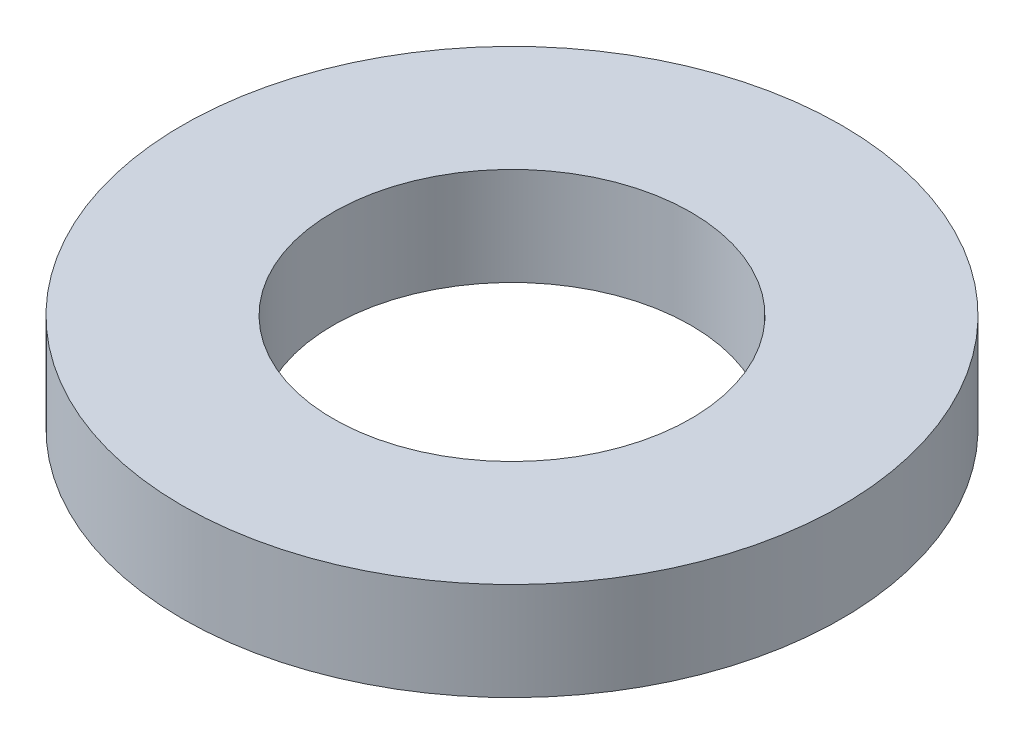
ISO-10303-21;
HEADER;
FILE_DESCRIPTION(('STEP AP214'),'2;1');
FILE_NAME('part.step','',(''),(''),'','','');
FILE_SCHEMA(('AUTOMOTIVE_DESIGN { 1 0 10303 214 1 1 1 1 }'));
ENDSEC;
DATA;
#1=APPLICATION_CONTEXT('core data for automotive mechanical design processes');
#2=APPLICATION_PROTOCOL_DEFINITION('international standard','automotive_design',2000,#1);
#3=PRODUCT_CONTEXT('',#1,'mechanical');
#4=PRODUCT('Part','Part','',(#3));
#5=PRODUCT_RELATED_PRODUCT_CATEGORY('part','',(#4));
#6=PRODUCT_DEFINITION_FORMATION('','',#4);
#7=PRODUCT_DEFINITION_CONTEXT('part definition',#1,'design');
#8=PRODUCT_DEFINITION('design','',#6,#7);
#9=PRODUCT_DEFINITION_SHAPE('','',#8);
#10=(LENGTH_UNIT() NAMED_UNIT(*) SI_UNIT(.MILLI.,.METRE.));
#11=(NAMED_UNIT(*) PLANE_ANGLE_UNIT() SI_UNIT($,.RADIAN.));
#12=(NAMED_UNIT(*) SI_UNIT($,.STERADIAN.) SOLID_ANGLE_UNIT());
#13=UNCERTAINTY_MEASURE_WITH_UNIT(LENGTH_MEASURE(1.E-05),#10,'distance_accuracy_value','');
#14=(GEOMETRIC_REPRESENTATION_CONTEXT(3) GLOBAL_UNCERTAINTY_ASSIGNED_CONTEXT((#13)) GLOBAL_UNIT_ASSIGNED_CONTEXT((#10,
#11,#12)) REPRESENTATION_CONTEXT('',''));
#15=CARTESIAN_POINT('',(0.,0.,0.));
#16=DIRECTION('',(0.,0.,1.));
#17=DIRECTION('',(1.,0.,0.));
#18=AXIS2_PLACEMENT_3D('',#15,#16,#17);
#19=CARTESIAN_POINT('',(0.,26.,0.));
#20=DIRECTION('',(0.,-1.,0.));
#21=DIRECTION('',(0.,0.,-1.));
#22=AXIS2_PLACEMENT_3D('',#19,#20,#21);
#23=CYLINDRICAL_SURFACE('',#22,87.5);
#24=CARTESIAN_POINT('',(0.,26.,0.));
#25=DIRECTION('',(0.,1.,0.));
#26=DIRECTION('',(0.,0.,1.));
#27=AXIS2_PLACEMENT_3D('',#24,#25,#26);
#28=CIRCLE('',#27,87.5);
#29=CARTESIAN_POINT('',(0.,26.,-87.5));
#30=VERTEX_POINT('',#29);
#31=EDGE_CURVE('E10',#30,#30,#28,.T.);
#32=CARTESIAN_POINT('',(0.,0.,0.));
#33=DIRECTION('',(0.,1.,0.));
#34=DIRECTION('',(0.,0.,1.));
#35=AXIS2_PLACEMENT_3D('',#32,#33,#34);
#36=CIRCLE('',#35,87.5);
#37=CARTESIAN_POINT('',(0.,0.,-87.5));
#38=VERTEX_POINT('',#37);
#39=EDGE_CURVE('E37',#38,#38,#36,.T.);
#40=CARTESIAN_POINT('',(0.,26.,-87.5));
#41=CARTESIAN_POINT('',(0.,25.7291666666667,-87.5));
#42=CARTESIAN_POINT('',(0.,25.4583333333333,-87.5));
#43=CARTESIAN_POINT('',(0.,24.9166666666667,-87.5));
#44=CARTESIAN_POINT('',(0.,24.6458333333333,-87.5));
#45=CARTESIAN_POINT('',(0.,24.1041666666667,-87.5));
#46=CARTESIAN_POINT('',(0.,23.8333333333333,-87.5));
#47=CARTESIAN_POINT('',(0.,23.2916666666667,-87.5));
#48=CARTESIAN_POINT('',(0.,23.0208333333333,-87.5));
#49=CARTESIAN_POINT('',(0.,22.4791666666667,-87.5));
#50=CARTESIAN_POINT('',(0.,22.2083333333333,-87.5));
#51=CARTESIAN_POINT('',(0.,21.6666666666667,-87.5));
#52=CARTESIAN_POINT('',(0.,21.3958333333333,-87.5));
#53=CARTESIAN_POINT('',(0.,20.8541666666667,-87.5));
#54=CARTESIAN_POINT('',(0.,20.5833333333333,-87.5));
#55=CARTESIAN_POINT('',(0.,20.0416666666667,-87.5));
#56=CARTESIAN_POINT('',(0.,19.7708333333333,-87.5));
#57=CARTESIAN_POINT('',(0.,19.2291666666667,-87.5));
#58=CARTESIAN_POINT('',(0.,18.9583333333333,-87.5));
#59=CARTESIAN_POINT('',(0.,18.4166666666667,-87.5));
#60=CARTESIAN_POINT('',(0.,18.1458333333333,-87.5));
#61=CARTESIAN_POINT('',(0.,17.6041666666667,-87.5));
#62=CARTESIAN_POINT('',(0.,17.3333333333333,-87.5));
#63=CARTESIAN_POINT('',(0.,16.7916666666667,-87.5));
#64=CARTESIAN_POINT('',(0.,16.5208333333333,-87.5));
#65=CARTESIAN_POINT('',(0.,15.9791666666667,-87.5));
#66=CARTESIAN_POINT('',(0.,15.7083333333333,-87.5));
#67=CARTESIAN_POINT('',(0.,15.1666666666667,-87.5));
#68=CARTESIAN_POINT('',(0.,14.8958333333333,-87.5));
#69=CARTESIAN_POINT('',(0.,14.3541666666667,-87.5));
#70=CARTESIAN_POINT('',(0.,14.0833333333333,-87.5));
#71=CARTESIAN_POINT('',(0.,13.5416666666667,-87.5));
#72=CARTESIAN_POINT('',(0.,13.2708333333333,-87.5));
#73=CARTESIAN_POINT('',(0.,12.7291666666667,-87.5));
#74=CARTESIAN_POINT('',(0.,12.4583333333333,-87.5));
#75=CARTESIAN_POINT('',(0.,11.9166666666667,-87.5));
#76=CARTESIAN_POINT('',(0.,11.6458333333333,-87.5));
#77=CARTESIAN_POINT('',(0.,11.1041666666667,-87.5));
#78=CARTESIAN_POINT('',(0.,10.8333333333333,-87.5));
#79=CARTESIAN_POINT('',(0.,10.2916666666667,-87.5));
#80=CARTESIAN_POINT('',(0.,10.0208333333333,-87.5));
#81=CARTESIAN_POINT('',(0.,9.47916666666667,-87.5));
#82=CARTESIAN_POINT('',(0.,9.20833333333333,-87.5));
#83=CARTESIAN_POINT('',(0.,8.66666666666667,-87.5));
#84=CARTESIAN_POINT('',(0.,8.39583333333333,-87.5));
#85=CARTESIAN_POINT('',(0.,7.85416666666667,-87.5));
#86=CARTESIAN_POINT('',(0.,7.58333333333333,-87.5));
#87=CARTESIAN_POINT('',(0.,7.04166666666667,-87.5));
#88=CARTESIAN_POINT('',(0.,6.77083333333333,-87.5));
#89=CARTESIAN_POINT('',(0.,6.22916666666667,-87.5));
#90=CARTESIAN_POINT('',(0.,5.95833333333333,-87.5));
#91=CARTESIAN_POINT('',(0.,5.41666666666667,-87.5));
#92=CARTESIAN_POINT('',(0.,5.14583333333333,-87.5));
#93=CARTESIAN_POINT('',(0.,4.60416666666667,-87.5));
#94=CARTESIAN_POINT('',(0.,4.33333333333333,-87.5));
#95=CARTESIAN_POINT('',(0.,3.79166666666667,-87.5));
#96=CARTESIAN_POINT('',(0.,3.52083333333333,-87.5));
#97=CARTESIAN_POINT('',(0.,2.97916666666667,-87.5));
#98=CARTESIAN_POINT('',(0.,2.70833333333333,-87.5));
#99=CARTESIAN_POINT('',(0.,2.16666666666667,-87.5));
#100=CARTESIAN_POINT('',(0.,1.89583333333333,-87.5));
#101=CARTESIAN_POINT('',(0.,1.35416666666667,-87.5));
#102=CARTESIAN_POINT('',(0.,1.08333333333333,-87.5));
#103=CARTESIAN_POINT('',(0.,0.541666666666667,-87.5));
#104=CARTESIAN_POINT('',(0.,0.270833333333334,-87.5));
#105=CARTESIAN_POINT('',(0.,0.,-87.5));
#106=B_SPLINE_CURVE_WITH_KNOTS('',3,(#40,#41,#42,#43,#44,#45,#46,#47,#48,#49,#50,#51,#52,#53,
#54,#55,#56,#57,#58,#59,#60,#61,#62,#63,#64,#65,#66,#67,#68,#69,#70,#71,#72,#73,#74,#75,#76,#77,
#78,#79,#80,#81,#82,#83,#84,#85,#86,#87,#88,#89,#90,#91,#92,#93,#94,#95,#96,#97,#98,#99,#100,
#101,#102,#103,#104,#105),.UNSPECIFIED.,.F.,.F.,(4,2,2,2,2,2,2,2,2,2,2,2,2,2,2,2,2,2,2,2,2,2,2,
2,2,2,2,2,2,2,2,2,4),(0.,0.812500000000001,1.625,2.4375,3.25,4.0625,4.875,5.6875,6.5,7.3125,
8.125,8.9375,9.75,10.5625,11.375,12.1875,13.,13.8125,14.625,15.4375,16.25,17.0625,17.875,
18.6875,19.5,20.3125,21.125,21.9375,22.75,23.5625,24.375,25.1875,26.),.UNSPECIFIED.);
#107=EDGE_CURVE('BSEAM40',#30,#38,#106,.T.);
#108=ORIENTED_EDGE('',*,*,#31,.F.);
#109=ORIENTED_EDGE('',*,*,#39,.T.);
#110=ORIENTED_EDGE('',*,*,#107,.T.);
#111=ORIENTED_EDGE('',*,*,#107,.F.);
#112=EDGE_LOOP('',(#108,#110,#109,#111));
#113=FACE_BOUND('',#112,.T.);
#114=ADVANCED_FACE('F40',(#113),#23,.T.);
#115=CARTESIAN_POINT('',(0.,26.,0.));
#116=DIRECTION('',(0.,1.,0.));
#117=DIRECTION('',(0.,0.,1.));
#118=AXIS2_PLACEMENT_3D('',#115,#116,#117);
#119=PLANE('',#118);
#120=CARTESIAN_POINT('',(0.,26.,0.));
#121=DIRECTION('',(0.,1.,0.));
#122=DIRECTION('',(0.,0.,1.));
#123=AXIS2_PLACEMENT_3D('',#120,#121,#122);
#124=CIRCLE('',#123,47.5);
#125=CARTESIAN_POINT('',(0.,26.,-47.5));
#126=VERTEX_POINT('',#125);
#127=EDGE_CURVE('E50',#126,#126,#124,.T.);
#128=ORIENTED_EDGE('',*,*,#127,.F.);
#129=EDGE_LOOP('',(#128));
#130=FACE_BOUND('',#129,.T.);
#131=ORIENTED_EDGE('',*,*,#31,.T.);
#132=EDGE_LOOP('',(#131));
#133=FACE_BOUND('',#132,.T.);
#134=ADVANCED_FACE('F59',(#130,#133),#119,.T.);
#135=CARTESIAN_POINT('',(0.,0.,0.));
#136=DIRECTION('',(0.,1.,0.));
#137=DIRECTION('',(0.,0.,1.));
#138=AXIS2_PLACEMENT_3D('',#135,#136,#137);
#139=PLANE('',#138);
#140=CARTESIAN_POINT('',(0.,0.,0.));
#141=DIRECTION('',(0.,1.,0.));
#142=DIRECTION('',(0.,0.,1.));
#143=AXIS2_PLACEMENT_3D('',#140,#141,#142);
#144=CIRCLE('',#143,47.5);
#145=CARTESIAN_POINT('',(0.,0.,-47.5));
#146=VERTEX_POINT('',#145);
#147=EDGE_CURVE('E47',#146,#146,#144,.T.);
#148=ORIENTED_EDGE('',*,*,#147,.T.);
#149=EDGE_LOOP('',(#148));
#150=FACE_BOUND('',#149,.T.);
#151=ORIENTED_EDGE('',*,*,#39,.F.);
#152=EDGE_LOOP('',(#151));
#153=FACE_BOUND('',#152,.T.);
#154=ADVANCED_FACE('F58',(#150,#153),#139,.F.);
#155=CARTESIAN_POINT('',(0.,26.,0.));
#156=DIRECTION('',(0.,-1.,0.));
#157=DIRECTION('',(0.,0.,-1.));
#158=AXIS2_PLACEMENT_3D('',#155,#156,#157);
#159=CYLINDRICAL_SURFACE('',#158,47.5);
#160=CARTESIAN_POINT('',(0.,26.,-47.5));
#161=CARTESIAN_POINT('',(0.,25.7291666666667,-47.5));
#162=CARTESIAN_POINT('',(0.,25.4583333333333,-47.5));
#163=CARTESIAN_POINT('',(0.,24.9166666666667,-47.5));
#164=CARTESIAN_POINT('',(0.,24.6458333333333,-47.5));
#165=CARTESIAN_POINT('',(0.,24.1041666666667,-47.5));
#166=CARTESIAN_POINT('',(0.,23.8333333333333,-47.5));
#167=CARTESIAN_POINT('',(0.,23.2916666666667,-47.5));
#168=CARTESIAN_POINT('',(0.,23.0208333333333,-47.5));
#169=CARTESIAN_POINT('',(0.,22.4791666666667,-47.5));
#170=CARTESIAN_POINT('',(0.,22.2083333333333,-47.5));
#171=CARTESIAN_POINT('',(0.,21.6666666666667,-47.5));
#172=CARTESIAN_POINT('',(0.,21.3958333333333,-47.5));
#173=CARTESIAN_POINT('',(0.,20.8541666666667,-47.5));
#174=CARTESIAN_POINT('',(0.,20.5833333333333,-47.5));
#175=CARTESIAN_POINT('',(0.,20.0416666666667,-47.5));
#176=CARTESIAN_POINT('',(0.,19.7708333333333,-47.5));
#177=CARTESIAN_POINT('',(0.,19.2291666666667,-47.5));
#178=CARTESIAN_POINT('',(0.,18.9583333333333,-47.5));
#179=CARTESIAN_POINT('',(0.,18.4166666666667,-47.5));
#180=CARTESIAN_POINT('',(0.,18.1458333333333,-47.5));
#181=CARTESIAN_POINT('',(0.,17.6041666666667,-47.5));
#182=CARTESIAN_POINT('',(0.,17.3333333333333,-47.5));
#183=CARTESIAN_POINT('',(0.,16.7916666666667,-47.5));
#184=CARTESIAN_POINT('',(0.,16.5208333333333,-47.5));
#185=CARTESIAN_POINT('',(0.,15.9791666666667,-47.5));
#186=CARTESIAN_POINT('',(0.,15.7083333333333,-47.5));
#187=CARTESIAN_POINT('',(0.,15.1666666666667,-47.5));
#188=CARTESIAN_POINT('',(0.,14.8958333333333,-47.5));
#189=CARTESIAN_POINT('',(0.,14.3541666666667,-47.5));
#190=CARTESIAN_POINT('',(0.,14.0833333333333,-47.5));
#191=CARTESIAN_POINT('',(0.,13.5416666666667,-47.5));
#192=CARTESIAN_POINT('',(0.,13.2708333333333,-47.5));
#193=CARTESIAN_POINT('',(0.,12.7291666666667,-47.5));
#194=CARTESIAN_POINT('',(0.,12.4583333333333,-47.5));
#195=CARTESIAN_POINT('',(0.,11.9166666666667,-47.5));
#196=CARTESIAN_POINT('',(0.,11.6458333333333,-47.5));
#197=CARTESIAN_POINT('',(0.,11.1041666666667,-47.5));
#198=CARTESIAN_POINT('',(0.,10.8333333333333,-47.5));
#199=CARTESIAN_POINT('',(0.,10.2916666666667,-47.5));
#200=CARTESIAN_POINT('',(0.,10.0208333333333,-47.5));
#201=CARTESIAN_POINT('',(0.,9.47916666666667,-47.5));
#202=CARTESIAN_POINT('',(0.,9.20833333333333,-47.5));
#203=CARTESIAN_POINT('',(0.,8.66666666666667,-47.5));
#204=CARTESIAN_POINT('',(0.,8.39583333333333,-47.5));
#205=CARTESIAN_POINT('',(0.,7.85416666666667,-47.5));
#206=CARTESIAN_POINT('',(0.,7.58333333333333,-47.5));
#207=CARTESIAN_POINT('',(0.,7.04166666666667,-47.5));
#208=CARTESIAN_POINT('',(0.,6.77083333333333,-47.5));
#209=CARTESIAN_POINT('',(0.,6.22916666666667,-47.5));
#210=CARTESIAN_POINT('',(0.,5.95833333333333,-47.5));
#211=CARTESIAN_POINT('',(0.,5.41666666666667,-47.5));
#212=CARTESIAN_POINT('',(0.,5.14583333333333,-47.5));
#213=CARTESIAN_POINT('',(0.,4.60416666666667,-47.5));
#214=CARTESIAN_POINT('',(0.,4.33333333333333,-47.5));
#215=CARTESIAN_POINT('',(0.,3.79166666666667,-47.5));
#216=CARTESIAN_POINT('',(0.,3.52083333333333,-47.5));
#217=CARTESIAN_POINT('',(0.,2.97916666666667,-47.5));
#218=CARTESIAN_POINT('',(0.,2.70833333333333,-47.5));
#219=CARTESIAN_POINT('',(0.,2.16666666666667,-47.5));
#220=CARTESIAN_POINT('',(0.,1.89583333333333,-47.5));
#221=CARTESIAN_POINT('',(0.,1.35416666666667,-47.5));
#222=CARTESIAN_POINT('',(0.,1.08333333333333,-47.5));
#223=CARTESIAN_POINT('',(0.,0.541666666666667,-47.5));
#224=CARTESIAN_POINT('',(0.,0.270833333333334,-47.5));
#225=CARTESIAN_POINT('',(0.,0.,-47.5));
#226=B_SPLINE_CURVE_WITH_KNOTS('',3,(#160,#161,#162,#163,#164,#165,#166,#167,#168,#169,#170,
#171,#172,#173,#174,#175,#176,#177,#178,#179,#180,#181,#182,#183,#184,#185,#186,#187,#188,#189,
#190,#191,#192,#193,#194,#195,#196,#197,#198,#199,#200,#201,#202,#203,#204,#205,#206,#207,#208,
#209,#210,#211,#212,#213,#214,#215,#216,#217,#218,#219,#220,#221,#222,#223,#224,#225),
.UNSPECIFIED.,.F.,.F.,(4,2,2,2,2,2,2,2,2,2,2,2,2,2,2,2,2,2,2,2,2,2,2,2,2,2,2,2,2,2,2,2,4),(0.,
0.812500000000001,1.625,2.4375,3.25,4.0625,4.875,5.6875,6.5,7.3125,8.125,8.9375,9.75,10.5625,
11.375,12.1875,13.,13.8125,14.625,15.4375,16.25,17.0625,17.875,18.6875,19.5,20.3125,21.125,
21.9375,22.75,23.5625,24.375,25.1875,26.),.UNSPECIFIED.);
#227=EDGE_CURVE('BSEAM54',#126,#146,#226,.T.);
#228=ORIENTED_EDGE('',*,*,#127,.T.);
#229=ORIENTED_EDGE('',*,*,#147,.F.);
#230=ORIENTED_EDGE('',*,*,#227,.T.);
#231=ORIENTED_EDGE('',*,*,#227,.F.);
#232=EDGE_LOOP('',(#228,#230,#229,#231));
#233=FACE_BOUND('',#232,.T.);
#234=ADVANCED_FACE('F54',(#233),#159,.F.);
#235=CLOSED_SHELL('',(#114,#134,#154,#234));
#236=MANIFOLD_SOLID_BREP('B2',#235);
#237=ADVANCED_BREP_SHAPE_REPRESENTATION('',(#18,#236),#14);
#238=SHAPE_DEFINITION_REPRESENTATION(#9,#237);
ENDSEC;
END-ISO-10303-21;
